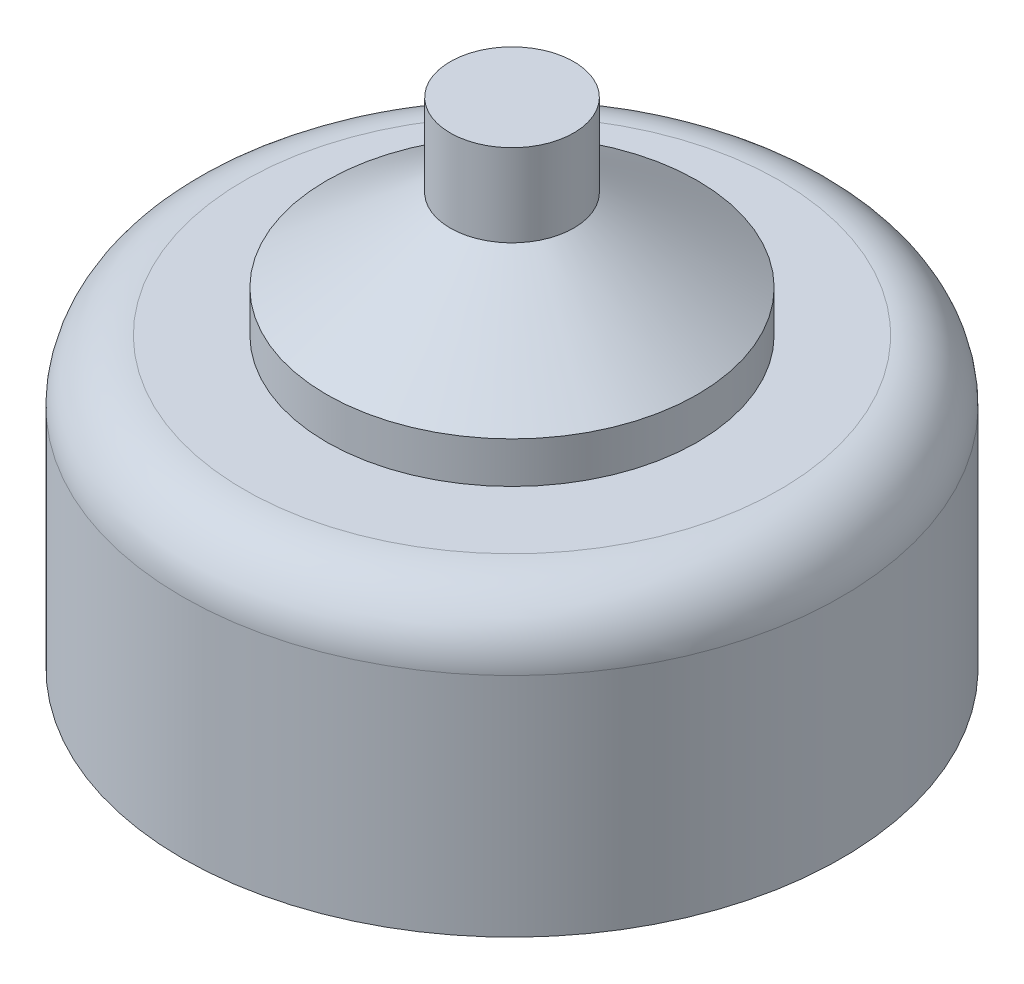
ISO-10303-21;
HEADER;
FILE_DESCRIPTION(('STEP AP214'),'2;1');
FILE_NAME('part.step','',(''),(''),'','','');
FILE_SCHEMA(('AUTOMOTIVE_DESIGN { 1 0 10303 214 1 1 1 1 }'));
ENDSEC;
DATA;
#1=APPLICATION_CONTEXT('core data for automotive mechanical design processes');
#2=APPLICATION_PROTOCOL_DEFINITION('international standard','automotive_design',2000,#1);
#3=PRODUCT_CONTEXT('',#1,'mechanical');
#4=PRODUCT('Part','Part','',(#3));
#5=PRODUCT_RELATED_PRODUCT_CATEGORY('part','',(#4));
#6=PRODUCT_DEFINITION_FORMATION('','',#4);
#7=PRODUCT_DEFINITION_CONTEXT('part definition',#1,'design');
#8=PRODUCT_DEFINITION('design','',#6,#7);
#9=PRODUCT_DEFINITION_SHAPE('','',#8);
#10=(LENGTH_UNIT() NAMED_UNIT(*) SI_UNIT(.MILLI.,.METRE.));
#11=(NAMED_UNIT(*) PLANE_ANGLE_UNIT() SI_UNIT($,.RADIAN.));
#12=(NAMED_UNIT(*) SI_UNIT($,.STERADIAN.) SOLID_ANGLE_UNIT());
#13=UNCERTAINTY_MEASURE_WITH_UNIT(LENGTH_MEASURE(1.E-05),#10,'distance_accuracy_value','');
#14=(GEOMETRIC_REPRESENTATION_CONTEXT(3) GLOBAL_UNCERTAINTY_ASSIGNED_CONTEXT((#13)) GLOBAL_UNIT_ASSIGNED_CONTEXT((#10,
#11,#12)) REPRESENTATION_CONTEXT('',''));
#15=CARTESIAN_POINT('',(0.,0.,0.));
#16=DIRECTION('',(0.,0.,1.));
#17=DIRECTION('',(1.,0.,0.));
#18=AXIS2_PLACEMENT_3D('',#15,#16,#17);
#19=CARTESIAN_POINT('',(0.,-30.0150074313569,0.));
#20=DIRECTION('',(0.,1.,0.));
#21=DIRECTION('',(0.,0.,1.));
#22=AXIS2_PLACEMENT_3D('',#19,#20,#21);
#23=PLANE('',#22);
#24=CARTESIAN_POINT('',(0.,-30.0150074313569,0.));
#25=DIRECTION('',(0.,1.,0.));
#26=DIRECTION('',(0.,0.,1.));
#27=AXIS2_PLACEMENT_3D('',#24,#25,#26);
#28=CIRCLE('',#27,8.00000000000003);
#29=CARTESIAN_POINT('',(0.,-30.0150074313569,8.00000000000003));
#30=VERTEX_POINT('',#29);
#31=EDGE_CURVE('E42',#30,#30,#28,.T.);
#32=ORIENTED_EDGE('',*,*,#31,.F.);
#33=EDGE_LOOP('',(#32));
#34=FACE_BOUND('',#33,.T.);
#35=ADVANCED_FACE('F31',(#34),#23,.F.);
#36=CARTESIAN_POINT('',(0.,46.0762167811797,0.));
#37=DIRECTION('',(0.,1.,0.));
#38=DIRECTION('',(0.,0.,1.));
#39=AXIS2_PLACEMENT_3D('',#36,#37,#38);
#40=CYLINDRICAL_SURFACE('',#39,8.00000000000003);
#41=CARTESIAN_POINT('',(0.,-24.5150074313569,0.));
#42=DIRECTION('',(0.,-1.,0.));
#43=DIRECTION('',(0.,0.,-1.));
#44=AXIS2_PLACEMENT_3D('',#41,#42,#43);
#45=CIRCLE('',#44,8.00000000000003);
#46=CARTESIAN_POINT('',(0.,-24.5150074313569,-8.00000000000003));
#47=VERTEX_POINT('',#46);
#48=EDGE_CURVE('E10',#47,#47,#45,.T.);
#49=ORIENTED_EDGE('',*,*,#48,.T.);
#50=EDGE_LOOP('',(#49));
#51=FACE_BOUND('',#50,.T.);
#52=ORIENTED_EDGE('',*,*,#31,.T.);
#53=EDGE_LOOP('',(#52));
#54=FACE_BOUND('',#53,.T.);
#55=ADVANCED_FACE('F83',(#51,#54),#40,.T.);
#56=CARTESIAN_POINT('',(8.00000000000003,-23.0150074313569,0.));
#57=DIRECTION('',(0.,-1.,0.));
#58=DIRECTION('',(0.,0.,-1.));
#59=AXIS2_PLACEMENT_3D('',#56,#57,#58);
#60=PLANE('',#59);
#61=CARTESIAN_POINT('',(0.,-23.0150074313569,0.));
#62=DIRECTION('',(0.,-1.,0.));
#63=DIRECTION('',(0.,0.,-1.));
#64=AXIS2_PLACEMENT_3D('',#61,#62,#63);
#65=CIRCLE('',#64,6.50000000000003);
#66=CARTESIAN_POINT('',(0.,-23.0150074313569,-6.50000000000003));
#67=VERTEX_POINT('',#66);
#68=EDGE_CURVE('E38',#67,#67,#65,.F.);
#69=ORIENTED_EDGE('',*,*,#68,.T.);
#70=EDGE_LOOP('',(#69));
#71=FACE_BOUND('',#70,.T.);
#72=CARTESIAN_POINT('',(0.,-23.0150074313569,0.));
#73=DIRECTION('',(0.,1.,0.));
#74=DIRECTION('',(0.,0.,1.));
#75=AXIS2_PLACEMENT_3D('',#72,#73,#74);
#76=CIRCLE('',#75,4.50000000000003);
#77=CARTESIAN_POINT('',(0.,-23.0150074313569,4.50000000000003));
#78=VERTEX_POINT('',#77);
#79=EDGE_CURVE('E46',#78,#78,#76,.T.);
#80=ORIENTED_EDGE('',*,*,#79,.F.);
#81=EDGE_LOOP('',(#80));
#82=FACE_BOUND('',#81,.T.);
#83=ADVANCED_FACE('F78',(#71,#82),#60,.F.);
#84=CARTESIAN_POINT('',(0.,46.0762167811797,0.));
#85=DIRECTION('',(0.,1.,0.));
#86=DIRECTION('',(0.,0.,1.));
#87=AXIS2_PLACEMENT_3D('',#84,#85,#86);
#88=CYLINDRICAL_SURFACE('',#87,4.50000000000003);
#89=CARTESIAN_POINT('',(0.,-22.0150074313569,0.));
#90=DIRECTION('',(0.,1.,0.));
#91=DIRECTION('',(0.,0.,1.));
#92=AXIS2_PLACEMENT_3D('',#89,#90,#91);
#93=CIRCLE('',#92,4.50000000000003);
#94=CARTESIAN_POINT('',(0.,-22.0150074313569,4.50000000000003));
#95=VERTEX_POINT('',#94);
#96=EDGE_CURVE('E51',#95,#95,#93,.T.);
#97=ORIENTED_EDGE('',*,*,#96,.F.);
#98=EDGE_LOOP('',(#97));
#99=FACE_BOUND('',#98,.T.);
#100=ORIENTED_EDGE('',*,*,#79,.T.);
#101=EDGE_LOOP('',(#100));
#102=FACE_BOUND('',#101,.T.);
#103=ADVANCED_FACE('F72',(#99,#102),#88,.T.);
#104=CARTESIAN_POINT('',(0.,-22.0150074313569,0.));
#105=DIRECTION('',(0.,-1.,0.));
#106=DIRECTION('',(0.,0.,-1.));
#107=AXIS2_PLACEMENT_3D('',#104,#105,#106);
#108=CONICAL_SURFACE('',#107,4.50000000000003,0.982793723247335);
#109=CARTESIAN_POINT('',(0.,-20.0150074313569,0.));
#110=DIRECTION('',(0.,1.,0.));
#111=DIRECTION('',(0.,0.,1.));
#112=AXIS2_PLACEMENT_3D('',#109,#110,#111);
#113=CIRCLE('',#112,1.50000000000001);
#114=CARTESIAN_POINT('',(0.,-20.0150074313569,1.50000000000001));
#115=VERTEX_POINT('',#114);
#116=EDGE_CURVE('E54',#115,#115,#113,.T.);
#117=ORIENTED_EDGE('',*,*,#116,.F.);
#118=EDGE_LOOP('',(#117));
#119=FACE_BOUND('',#118,.T.);
#120=ORIENTED_EDGE('',*,*,#96,.T.);
#121=EDGE_LOOP('',(#120));
#122=FACE_BOUND('',#121,.T.);
#123=ADVANCED_FACE('F66',(#119,#122),#108,.T.);
#124=CARTESIAN_POINT('',(0.,46.0762167811797,0.));
#125=DIRECTION('',(0.,1.,0.));
#126=DIRECTION('',(0.,0.,1.));
#127=AXIS2_PLACEMENT_3D('',#124,#125,#126);
#128=CYLINDRICAL_SURFACE('',#127,1.50000000000001);
#129=CARTESIAN_POINT('',(0.,-18.0150074313569,0.));
#130=DIRECTION('',(0.,1.,0.));
#131=DIRECTION('',(0.,0.,1.));
#132=AXIS2_PLACEMENT_3D('',#129,#130,#131);
#133=CIRCLE('',#132,1.50000000000001);
#134=CARTESIAN_POINT('',(0.,-18.0150074313569,1.50000000000001));
#135=VERTEX_POINT('',#134);
#136=EDGE_CURVE('E57',#135,#135,#133,.T.);
#137=ORIENTED_EDGE('',*,*,#136,.F.);
#138=EDGE_LOOP('',(#137));
#139=FACE_BOUND('',#138,.T.);
#140=ORIENTED_EDGE('',*,*,#116,.T.);
#141=EDGE_LOOP('',(#140));
#142=FACE_BOUND('',#141,.T.);
#143=ADVANCED_FACE('F63',(#139,#142),#128,.T.);
#144=CARTESIAN_POINT('',(1.50000000000001,-18.0150074313569,0.));
#145=DIRECTION('',(0.,-1.,0.));
#146=DIRECTION('',(0.,0.,-1.));
#147=AXIS2_PLACEMENT_3D('',#144,#145,#146);
#148=PLANE('',#147);
#149=ORIENTED_EDGE('',*,*,#136,.T.);
#150=EDGE_LOOP('',(#149));
#151=FACE_BOUND('',#150,.T.);
#152=ADVANCED_FACE('F61',(#151),#148,.F.);
#153=CARTESIAN_POINT('',(0.,-24.5150074313569,0.));
#154=DIRECTION('',(0.,-1.,0.));
#155=DIRECTION('',(0.,0.,-1.));
#156=AXIS2_PLACEMENT_3D('',#153,#154,#155);
#157=TOROIDAL_SURFACE('',#156,6.50000000000003,1.5);
#158=ORIENTED_EDGE('',*,*,#48,.F.);
#159=EDGE_LOOP('',(#158));
#160=FACE_BOUND('',#159,.T.);
#161=ORIENTED_EDGE('',*,*,#68,.F.);
#162=EDGE_LOOP('',(#161));
#163=FACE_BOUND('',#162,.T.);
#164=ADVANCED_FACE('F33',(#160,#163),#157,.T.);
#165=CLOSED_SHELL('',(#35,#55,#83,#103,#123,#143,#152,#164));
#166=MANIFOLD_SOLID_BREP('B2',#165);
#167=ADVANCED_BREP_SHAPE_REPRESENTATION('',(#18,#166),#14);
#168=SHAPE_DEFINITION_REPRESENTATION(#9,#167);
ENDSEC;
END-ISO-10303-21;
